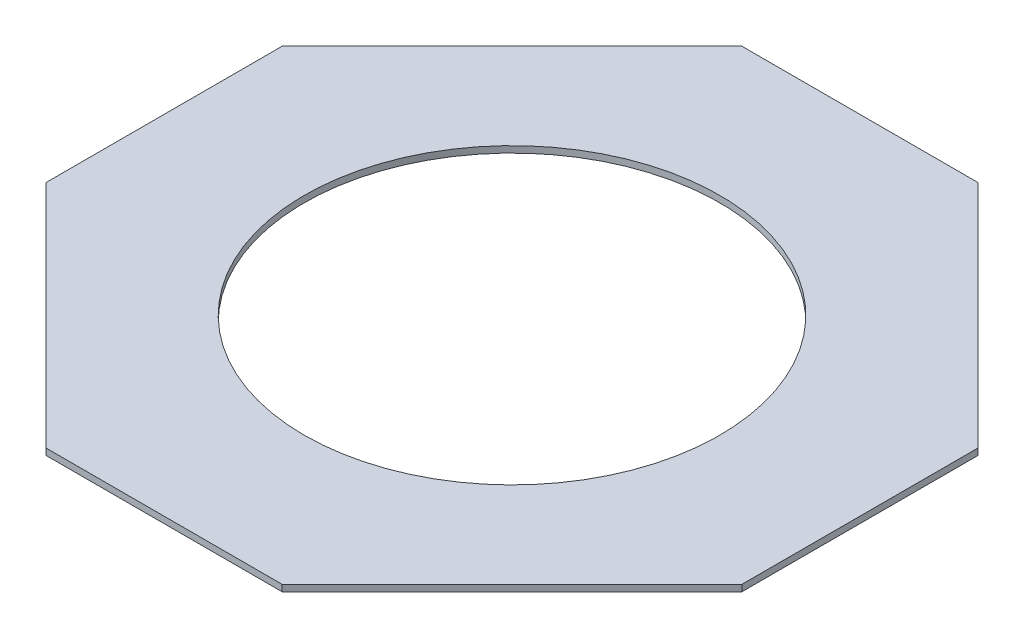
ISO-10303-21;
HEADER;
FILE_DESCRIPTION(('STEP AP214'),'2;1');
FILE_NAME('part.step','',(''),(''),'','','');
FILE_SCHEMA(('AUTOMOTIVE_DESIGN { 1 0 10303 214 1 1 1 1 }'));
ENDSEC;
DATA;
#1=APPLICATION_CONTEXT('core data for automotive mechanical design processes');
#2=APPLICATION_PROTOCOL_DEFINITION('international standard','automotive_design',2000,#1);
#3=PRODUCT_CONTEXT('',#1,'mechanical');
#4=PRODUCT('Part','Part','',(#3));
#5=PRODUCT_RELATED_PRODUCT_CATEGORY('part','',(#4));
#6=PRODUCT_DEFINITION_FORMATION('','',#4);
#7=PRODUCT_DEFINITION_CONTEXT('part definition',#1,'design');
#8=PRODUCT_DEFINITION('design','',#6,#7);
#9=PRODUCT_DEFINITION_SHAPE('','',#8);
#10=(LENGTH_UNIT() NAMED_UNIT(*) SI_UNIT(.MILLI.,.METRE.));
#11=(NAMED_UNIT(*) PLANE_ANGLE_UNIT() SI_UNIT($,.RADIAN.));
#12=(NAMED_UNIT(*) SI_UNIT($,.STERADIAN.) SOLID_ANGLE_UNIT());
#13=UNCERTAINTY_MEASURE_WITH_UNIT(LENGTH_MEASURE(1.E-05),#10,'distance_accuracy_value','');
#14=(GEOMETRIC_REPRESENTATION_CONTEXT(3) GLOBAL_UNCERTAINTY_ASSIGNED_CONTEXT((#13)) GLOBAL_UNIT_ASSIGNED_CONTEXT((#10,
#11,#12)) REPRESENTATION_CONTEXT('',''));
#15=CARTESIAN_POINT('',(0.,0.,0.));
#16=DIRECTION('',(0.,0.,1.));
#17=DIRECTION('',(1.,0.,0.));
#18=AXIS2_PLACEMENT_3D('',#15,#16,#17);
#19=CARTESIAN_POINT('',(0.,1.3,0.));
#20=DIRECTION('',(0.,1.,0.));
#21=DIRECTION('',(0.,0.,1.));
#22=AXIS2_PLACEMENT_3D('',#19,#20,#21);
#23=PLANE('',#22);
#24=DIRECTION('',(-0.707106781186547,0.,0.707106781186547));
#25=VECTOR('',#24,1.);
#26=CARTESIAN_POINT('',(70.,1.3,23.75));
#27=LINE('',#26,#25);
#28=CARTESIAN_POINT('',(70.,1.3,23.75));
#29=VERTEX_POINT('',#28);
#30=CARTESIAN_POINT('',(23.75,1.3,70.));
#31=VERTEX_POINT('',#30);
#32=EDGE_CURVE('E189',#29,#31,#27,.T.);
#33=ORIENTED_EDGE('',*,*,#32,.F.);
#34=DIRECTION('',(0.,0.,-1.));
#35=VECTOR('',#34,1.);
#36=CARTESIAN_POINT('',(70.,1.3,23.75));
#37=LINE('',#36,#35);
#38=CARTESIAN_POINT('',(70.,1.3,-23.75));
#39=VERTEX_POINT('',#38);
#40=EDGE_CURVE('E148',#29,#39,#37,.T.);
#41=ORIENTED_EDGE('',*,*,#40,.T.);
#42=DIRECTION('',(-0.707106781186547,0.,-0.707106781186547));
#43=VECTOR('',#42,1.);
#44=CARTESIAN_POINT('',(70.,1.3,-23.75));
#45=LINE('',#44,#43);
#46=CARTESIAN_POINT('',(23.75,1.3,-70.));
#47=VERTEX_POINT('',#46);
#48=EDGE_CURVE('E140',#39,#47,#45,.T.);
#49=ORIENTED_EDGE('',*,*,#48,.T.);
#50=DIRECTION('',(-1.,0.,0.));
#51=VECTOR('',#50,1.);
#52=CARTESIAN_POINT('',(23.75,1.3,-70.));
#53=LINE('',#52,#51);
#54=CARTESIAN_POINT('',(-23.75,1.3,-70.));
#55=VERTEX_POINT('',#54);
#56=EDGE_CURVE('E146',#47,#55,#53,.T.);
#57=ORIENTED_EDGE('',*,*,#56,.T.);
#58=DIRECTION('',(0.707106781186547,0.,-0.707106781186547));
#59=VECTOR('',#58,1.);
#60=CARTESIAN_POINT('',(-70.,1.3,-23.75));
#61=LINE('',#60,#59);
#62=CARTESIAN_POINT('',(-70.,1.3,-23.75));
#63=VERTEX_POINT('',#62);
#64=EDGE_CURVE('E163',#63,#55,#61,.T.);
#65=ORIENTED_EDGE('',*,*,#64,.F.);
#66=DIRECTION('',(0.,0.,-1.));
#67=VECTOR('',#66,1.);
#68=CARTESIAN_POINT('',(-70.,1.3,23.75));
#69=LINE('',#68,#67);
#70=CARTESIAN_POINT('',(-70.,1.3,23.75));
#71=VERTEX_POINT('',#70);
#72=EDGE_CURVE('E165',#71,#63,#69,.T.);
#73=ORIENTED_EDGE('',*,*,#72,.F.);
#74=DIRECTION('',(0.707106781186547,0.,0.707106781186547));
#75=VECTOR('',#74,1.);
#76=CARTESIAN_POINT('',(-70.,1.3,23.75));
#77=LINE('',#76,#75);
#78=CARTESIAN_POINT('',(-23.75,1.3,70.));
#79=VERTEX_POINT('',#78);
#80=EDGE_CURVE('E212',#71,#79,#77,.T.);
#81=ORIENTED_EDGE('',*,*,#80,.T.);
#82=DIRECTION('',(-1.,0.,0.));
#83=VECTOR('',#82,1.);
#84=CARTESIAN_POINT('',(23.75,1.3,70.));
#85=LINE('',#84,#83);
#86=EDGE_CURVE('E213',#31,#79,#85,.T.);
#87=ORIENTED_EDGE('',*,*,#86,.F.);
#88=EDGE_LOOP('',(#33,#41,#49,#57,#65,#73,#81,#87));
#89=FACE_BOUND('',#88,.T.);
#90=CARTESIAN_POINT('',(0.,1.3,0.));
#91=DIRECTION('',(0.,1.,0.));
#92=DIRECTION('',(0.,0.,1.));
#93=AXIS2_PLACEMENT_3D('',#90,#91,#92);
#94=CIRCLE('',#93,41.8);
#95=CARTESIAN_POINT('',(0.,1.3,41.8));
#96=VERTEX_POINT('',#95);
#97=EDGE_CURVE('E174',#96,#96,#94,.T.);
#98=ORIENTED_EDGE('',*,*,#97,.F.);
#99=EDGE_LOOP('',(#98));
#100=FACE_BOUND('',#99,.T.);
#101=ADVANCED_FACE('F70',(#89,#100),#23,.T.);
#102=CARTESIAN_POINT('',(0.,0.,0.));
#103=DIRECTION('',(0.,1.,0.));
#104=DIRECTION('',(0.,0.,1.));
#105=AXIS2_PLACEMENT_3D('',#102,#103,#104);
#106=PLANE('',#105);
#107=DIRECTION('',(-0.707106781186547,0.,0.707106781186547));
#108=VECTOR('',#107,1.);
#109=CARTESIAN_POINT('',(70.,0.,23.75));
#110=LINE('',#109,#108);
#111=CARTESIAN_POINT('',(70.,0.,23.75));
#112=VERTEX_POINT('',#111);
#113=CARTESIAN_POINT('',(23.75,0.,70.));
#114=VERTEX_POINT('',#113);
#115=EDGE_CURVE('E170',#112,#114,#110,.T.);
#116=ORIENTED_EDGE('',*,*,#115,.T.);
#117=DIRECTION('',(-1.,0.,0.));
#118=VECTOR('',#117,1.);
#119=CARTESIAN_POINT('',(23.75,0.,70.));
#120=LINE('',#119,#118);
#121=CARTESIAN_POINT('',(-23.75,0.,70.));
#122=VERTEX_POINT('',#121);
#123=EDGE_CURVE('E173',#114,#122,#120,.T.);
#124=ORIENTED_EDGE('',*,*,#123,.T.);
#125=DIRECTION('',(0.707106781186547,0.,0.707106781186547));
#126=VECTOR('',#125,1.);
#127=CARTESIAN_POINT('',(-70.,0.,23.75));
#128=LINE('',#127,#126);
#129=CARTESIAN_POINT('',(-70.,0.,23.75));
#130=VERTEX_POINT('',#129);
#131=EDGE_CURVE('E177',#130,#122,#128,.T.);
#132=ORIENTED_EDGE('',*,*,#131,.F.);
#133=DIRECTION('',(0.,0.,-1.));
#134=VECTOR('',#133,1.);
#135=CARTESIAN_POINT('',(-70.,0.,23.75));
#136=LINE('',#135,#134);
#137=CARTESIAN_POINT('',(-70.,0.,-23.75));
#138=VERTEX_POINT('',#137);
#139=EDGE_CURVE('E180',#130,#138,#136,.T.);
#140=ORIENTED_EDGE('',*,*,#139,.T.);
#141=DIRECTION('',(0.707106781186547,0.,-0.707106781186547));
#142=VECTOR('',#141,1.);
#143=CARTESIAN_POINT('',(-70.,0.,-23.75));
#144=LINE('',#143,#142);
#145=CARTESIAN_POINT('',(-23.75,0.,-70.));
#146=VERTEX_POINT('',#145);
#147=EDGE_CURVE('E183',#138,#146,#144,.T.);
#148=ORIENTED_EDGE('',*,*,#147,.T.);
#149=DIRECTION('',(-1.,0.,0.));
#150=VECTOR('',#149,1.);
#151=CARTESIAN_POINT('',(23.75,0.,-70.));
#152=LINE('',#151,#150);
#153=CARTESIAN_POINT('',(23.75,0.,-70.));
#154=VERTEX_POINT('',#153);
#155=EDGE_CURVE('E186',#154,#146,#152,.T.);
#156=ORIENTED_EDGE('',*,*,#155,.F.);
#157=DIRECTION('',(-0.707106781186547,0.,-0.707106781186547));
#158=VECTOR('',#157,1.);
#159=CARTESIAN_POINT('',(70.,0.,-23.75));
#160=LINE('',#159,#158);
#161=CARTESIAN_POINT('',(70.,0.,-23.75));
#162=VERTEX_POINT('',#161);
#163=EDGE_CURVE('E155',#162,#154,#160,.T.);
#164=ORIENTED_EDGE('',*,*,#163,.F.);
#165=DIRECTION('',(0.,0.,-1.));
#166=VECTOR('',#165,1.);
#167=CARTESIAN_POINT('',(70.,0.,23.75));
#168=LINE('',#167,#166);
#169=EDGE_CURVE('E116',#112,#162,#168,.T.);
#170=ORIENTED_EDGE('',*,*,#169,.F.);
#171=EDGE_LOOP('',(#116,#124,#132,#140,#148,#156,#164,#170));
#172=FACE_BOUND('',#171,.T.);
#173=CARTESIAN_POINT('',(0.,0.,0.));
#174=DIRECTION('',(0.,1.,0.));
#175=DIRECTION('',(0.,0.,1.));
#176=AXIS2_PLACEMENT_3D('',#173,#174,#175);
#177=CIRCLE('',#176,41.8);
#178=CARTESIAN_POINT('',(0.,0.,41.8));
#179=VERTEX_POINT('',#178);
#180=EDGE_CURVE('E218',#179,#179,#177,.T.);
#181=ORIENTED_EDGE('',*,*,#180,.T.);
#182=EDGE_LOOP('',(#181));
#183=FACE_BOUND('',#182,.T.);
#184=ADVANCED_FACE('F201',(#172,#183),#106,.F.);
#185=CARTESIAN_POINT('',(70.,1.3,23.75));
#186=DIRECTION('',(0.707106781186548,0.,0.707106781186548));
#187=DIRECTION('',(0.707106781186548,0.,-0.707106781186548));
#188=AXIS2_PLACEMENT_3D('',#185,#186,#187);
#189=PLANE('',#188);
#190=ORIENTED_EDGE('',*,*,#115,.F.);
#191=DIRECTION('',(0.,-1.,0.));
#192=VECTOR('',#191,1.);
#193=CARTESIAN_POINT('',(70.,1.3,23.75));
#194=LINE('',#193,#192);
#195=EDGE_CURVE('E12',#29,#112,#194,.T.);
#196=ORIENTED_EDGE('',*,*,#195,.F.);
#197=ORIENTED_EDGE('',*,*,#32,.T.);
#198=DIRECTION('',(0.,-1.,0.));
#199=VECTOR('',#198,1.);
#200=CARTESIAN_POINT('',(23.75,1.3,70.));
#201=LINE('',#200,#199);
#202=EDGE_CURVE('E74',#31,#114,#201,.T.);
#203=ORIENTED_EDGE('',*,*,#202,.T.);
#204=EDGE_LOOP('',(#190,#196,#197,#203));
#205=FACE_BOUND('',#204,.T.);
#206=ADVANCED_FACE('F72',(#205),#189,.T.);
#207=CARTESIAN_POINT('',(70.,1.3,23.75));
#208=DIRECTION('',(-1.,0.,0.));
#209=DIRECTION('',(0.,0.,1.));
#210=AXIS2_PLACEMENT_3D('',#207,#208,#209);
#211=PLANE('',#210);
#212=ORIENTED_EDGE('',*,*,#169,.T.);
#213=DIRECTION('',(0.,-1.,0.));
#214=VECTOR('',#213,1.);
#215=CARTESIAN_POINT('',(70.,1.3,-23.75));
#216=LINE('',#215,#214);
#217=EDGE_CURVE('E80',#39,#162,#216,.T.);
#218=ORIENTED_EDGE('',*,*,#217,.F.);
#219=ORIENTED_EDGE('',*,*,#40,.F.);
#220=ORIENTED_EDGE('',*,*,#195,.T.);
#221=EDGE_LOOP('',(#212,#218,#219,#220));
#222=FACE_BOUND('',#221,.T.);
#223=ADVANCED_FACE('F234',(#222),#211,.F.);
#224=CARTESIAN_POINT('',(70.,1.3,-23.75));
#225=DIRECTION('',(-0.707106781186548,0.,0.707106781186548));
#226=DIRECTION('',(0.707106781186548,0.,0.707106781186548));
#227=AXIS2_PLACEMENT_3D('',#224,#225,#226);
#228=PLANE('',#227);
#229=ORIENTED_EDGE('',*,*,#163,.T.);
#230=DIRECTION('',(0.,-1.,0.));
#231=VECTOR('',#230,1.);
#232=CARTESIAN_POINT('',(23.75,1.3,-70.));
#233=LINE('',#232,#231);
#234=EDGE_CURVE('E152',#47,#154,#233,.T.);
#235=ORIENTED_EDGE('',*,*,#234,.F.);
#236=ORIENTED_EDGE('',*,*,#48,.F.);
#237=ORIENTED_EDGE('',*,*,#217,.T.);
#238=EDGE_LOOP('',(#229,#235,#236,#237));
#239=FACE_BOUND('',#238,.T.);
#240=ADVANCED_FACE('F153',(#239),#228,.F.);
#241=CARTESIAN_POINT('',(23.75,1.3,-70.));
#242=DIRECTION('',(0.,0.,1.));
#243=DIRECTION('',(1.,0.,0.));
#244=AXIS2_PLACEMENT_3D('',#241,#242,#243);
#245=PLANE('',#244);
#246=ORIENTED_EDGE('',*,*,#155,.T.);
#247=DIRECTION('',(0.,-1.,0.));
#248=VECTOR('',#247,1.);
#249=CARTESIAN_POINT('',(-23.75,1.3,-70.));
#250=LINE('',#249,#248);
#251=EDGE_CURVE('E159',#55,#146,#250,.T.);
#252=ORIENTED_EDGE('',*,*,#251,.F.);
#253=ORIENTED_EDGE('',*,*,#56,.F.);
#254=ORIENTED_EDGE('',*,*,#234,.T.);
#255=EDGE_LOOP('',(#246,#252,#253,#254));
#256=FACE_BOUND('',#255,.T.);
#257=ADVANCED_FACE('F161',(#256),#245,.F.);
#258=CARTESIAN_POINT('',(-70.,1.3,-23.75));
#259=DIRECTION('',(-0.707106781186548,0.,-0.707106781186548));
#260=DIRECTION('',(-0.707106781186548,0.,0.707106781186548));
#261=AXIS2_PLACEMENT_3D('',#258,#259,#260);
#262=PLANE('',#261);
#263=ORIENTED_EDGE('',*,*,#147,.F.);
#264=DIRECTION('',(0.,-1.,0.));
#265=VECTOR('',#264,1.);
#266=CARTESIAN_POINT('',(-70.,1.3,-23.75));
#267=LINE('',#266,#265);
#268=EDGE_CURVE('E193',#63,#138,#267,.T.);
#269=ORIENTED_EDGE('',*,*,#268,.F.);
#270=ORIENTED_EDGE('',*,*,#64,.T.);
#271=ORIENTED_EDGE('',*,*,#251,.T.);
#272=EDGE_LOOP('',(#263,#269,#270,#271));
#273=FACE_BOUND('',#272,.T.);
#274=ADVANCED_FACE('F206',(#273),#262,.T.);
#275=CARTESIAN_POINT('',(-70.,1.3,23.75));
#276=DIRECTION('',(-1.,0.,0.));
#277=DIRECTION('',(0.,0.,1.));
#278=AXIS2_PLACEMENT_3D('',#275,#276,#277);
#279=PLANE('',#278);
#280=ORIENTED_EDGE('',*,*,#139,.F.);
#281=DIRECTION('',(0.,-1.,0.));
#282=VECTOR('',#281,1.);
#283=CARTESIAN_POINT('',(-70.,1.3,23.75));
#284=LINE('',#283,#282);
#285=EDGE_CURVE('E195',#71,#130,#284,.T.);
#286=ORIENTED_EDGE('',*,*,#285,.F.);
#287=ORIENTED_EDGE('',*,*,#72,.T.);
#288=ORIENTED_EDGE('',*,*,#268,.T.);
#289=EDGE_LOOP('',(#280,#286,#287,#288));
#290=FACE_BOUND('',#289,.T.);
#291=ADVANCED_FACE('F210',(#290),#279,.T.);
#292=CARTESIAN_POINT('',(-70.,1.3,23.75));
#293=DIRECTION('',(0.707106781186548,0.,-0.707106781186548));
#294=DIRECTION('',(-0.707106781186548,0.,-0.707106781186548));
#295=AXIS2_PLACEMENT_3D('',#292,#293,#294);
#296=PLANE('',#295);
#297=ORIENTED_EDGE('',*,*,#131,.T.);
#298=DIRECTION('',(0.,-1.,0.));
#299=VECTOR('',#298,1.);
#300=CARTESIAN_POINT('',(-23.75,1.3,70.));
#301=LINE('',#300,#299);
#302=EDGE_CURVE('E196',#79,#122,#301,.T.);
#303=ORIENTED_EDGE('',*,*,#302,.F.);
#304=ORIENTED_EDGE('',*,*,#80,.F.);
#305=ORIENTED_EDGE('',*,*,#285,.T.);
#306=EDGE_LOOP('',(#297,#303,#304,#305));
#307=FACE_BOUND('',#306,.T.);
#308=ADVANCED_FACE('F245',(#307),#296,.F.);
#309=CARTESIAN_POINT('',(23.75,1.3,70.));
#310=DIRECTION('',(0.,0.,1.));
#311=DIRECTION('',(1.,0.,0.));
#312=AXIS2_PLACEMENT_3D('',#309,#310,#311);
#313=PLANE('',#312);
#314=ORIENTED_EDGE('',*,*,#123,.F.);
#315=ORIENTED_EDGE('',*,*,#202,.F.);
#316=ORIENTED_EDGE('',*,*,#86,.T.);
#317=ORIENTED_EDGE('',*,*,#302,.T.);
#318=EDGE_LOOP('',(#314,#315,#316,#317));
#319=FACE_BOUND('',#318,.T.);
#320=ADVANCED_FACE('F198',(#319),#313,.T.);
#321=CARTESIAN_POINT('',(0.,1.3,0.));
#322=DIRECTION('',(0.,-1.,0.));
#323=DIRECTION('',(0.,0.,-1.));
#324=AXIS2_PLACEMENT_3D('',#321,#322,#323);
#325=CYLINDRICAL_SURFACE('',#324,41.8);
#326=ORIENTED_EDGE('',*,*,#97,.T.);
#327=EDGE_LOOP('',(#326));
#328=FACE_BOUND('',#327,.T.);
#329=ORIENTED_EDGE('',*,*,#180,.F.);
#330=EDGE_LOOP('',(#329));
#331=FACE_BOUND('',#330,.T.);
#332=ADVANCED_FACE('F224',(#328,#331),#325,.F.);
#333=CLOSED_SHELL('',(#101,#184,#206,#223,#240,#257,#274,#291,#308,#320,#332));
#334=MANIFOLD_SOLID_BREP('B2',#333);
#335=ADVANCED_BREP_SHAPE_REPRESENTATION('',(#18,#334),#14);
#336=SHAPE_DEFINITION_REPRESENTATION(#9,#335);
ENDSEC;
END-ISO-10303-21;
